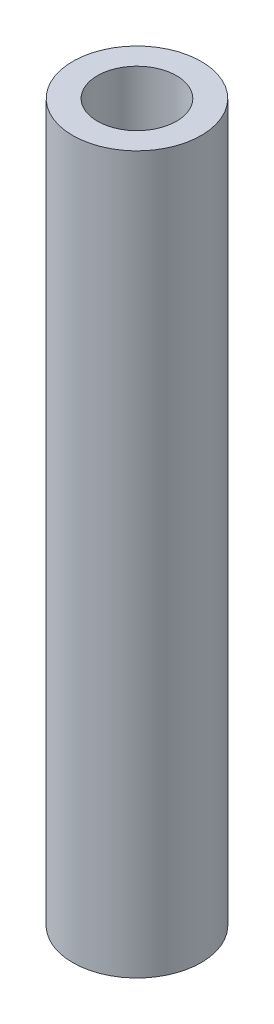
ISO-10303-21;
HEADER;
FILE_DESCRIPTION(('STEP AP214'),'2;1');
FILE_NAME('part.step','',(''),(''),'','','');
FILE_SCHEMA(('AUTOMOTIVE_DESIGN { 1 0 10303 214 1 1 1 1 }'));
ENDSEC;
DATA;
#1=APPLICATION_CONTEXT('core data for automotive mechanical design processes');
#2=APPLICATION_PROTOCOL_DEFINITION('international standard','automotive_design',2000,#1);
#3=PRODUCT_CONTEXT('',#1,'mechanical');
#4=PRODUCT('Part','Part','',(#3));
#5=PRODUCT_RELATED_PRODUCT_CATEGORY('part','',(#4));
#6=PRODUCT_DEFINITION_FORMATION('','',#4);
#7=PRODUCT_DEFINITION_CONTEXT('part definition',#1,'design');
#8=PRODUCT_DEFINITION('design','',#6,#7);
#9=PRODUCT_DEFINITION_SHAPE('','',#8);
#10=(LENGTH_UNIT() NAMED_UNIT(*) SI_UNIT(.MILLI.,.METRE.));
#11=(NAMED_UNIT(*) PLANE_ANGLE_UNIT() SI_UNIT($,.RADIAN.));
#12=(NAMED_UNIT(*) SI_UNIT($,.STERADIAN.) SOLID_ANGLE_UNIT());
#13=UNCERTAINTY_MEASURE_WITH_UNIT(LENGTH_MEASURE(1.E-05),#10,'distance_accuracy_value','');
#14=(GEOMETRIC_REPRESENTATION_CONTEXT(3) GLOBAL_UNCERTAINTY_ASSIGNED_CONTEXT((#13)) GLOBAL_UNIT_ASSIGNED_CONTEXT((#10,
#11,#12)) REPRESENTATION_CONTEXT('',''));
#15=CARTESIAN_POINT('',(0.,0.,0.));
#16=DIRECTION('',(0.,0.,1.));
#17=DIRECTION('',(1.,0.,0.));
#18=AXIS2_PLACEMENT_3D('',#15,#16,#17);
#19=CARTESIAN_POINT('',(0.,29.,0.));
#20=DIRECTION('',(0.,1.,0.));
#21=DIRECTION('',(0.,0.,1.));
#22=AXIS2_PLACEMENT_3D('',#19,#20,#21);
#23=PLANE('',#22);
#24=CARTESIAN_POINT('',(0.,29.,0.));
#25=DIRECTION('',(0.,1.,0.));
#26=DIRECTION('',(0.,0.,1.));
#27=AXIS2_PLACEMENT_3D('',#24,#25,#26);
#28=CIRCLE('',#27,2.6);
#29=CARTESIAN_POINT('',(0.,29.,2.6));
#30=VERTEX_POINT('',#29);
#31=EDGE_CURVE('E10',#30,#30,#28,.T.);
#32=ORIENTED_EDGE('',*,*,#31,.T.);
#33=EDGE_LOOP('',(#32));
#34=FACE_BOUND('',#33,.T.);
#35=CARTESIAN_POINT('',(0.,29.,0.));
#36=DIRECTION('',(0.,1.,0.));
#37=DIRECTION('',(0.,0.,1.));
#38=AXIS2_PLACEMENT_3D('',#35,#36,#37);
#39=CIRCLE('',#38,1.6);
#40=CARTESIAN_POINT('',(0.,29.,1.6));
#41=VERTEX_POINT('',#40);
#42=EDGE_CURVE('E50',#41,#41,#39,.T.);
#43=ORIENTED_EDGE('',*,*,#42,.F.);
#44=EDGE_LOOP('',(#43));
#45=FACE_BOUND('',#44,.T.);
#46=ADVANCED_FACE('F37',(#34,#45),#23,.T.);
#47=CARTESIAN_POINT('',(0.,0.,0.));
#48=DIRECTION('',(0.,1.,0.));
#49=DIRECTION('',(0.,0.,1.));
#50=AXIS2_PLACEMENT_3D('',#47,#48,#49);
#51=PLANE('',#50);
#52=CARTESIAN_POINT('',(0.,0.,0.));
#53=DIRECTION('',(0.,1.,0.));
#54=DIRECTION('',(0.,0.,1.));
#55=AXIS2_PLACEMENT_3D('',#52,#53,#54);
#56=CIRCLE('',#55,2.6);
#57=CARTESIAN_POINT('',(0.,0.,2.6));
#58=VERTEX_POINT('',#57);
#59=EDGE_CURVE('E41',#58,#58,#56,.T.);
#60=ORIENTED_EDGE('',*,*,#59,.F.);
#61=EDGE_LOOP('',(#60));
#62=FACE_BOUND('',#61,.T.);
#63=CARTESIAN_POINT('',(0.,0.,0.));
#64=DIRECTION('',(0.,1.,0.));
#65=DIRECTION('',(0.,0.,1.));
#66=AXIS2_PLACEMENT_3D('',#63,#64,#65);
#67=CIRCLE('',#66,1.6);
#68=CARTESIAN_POINT('',(0.,0.,1.6));
#69=VERTEX_POINT('',#68);
#70=EDGE_CURVE('E52',#69,#69,#67,.T.);
#71=ORIENTED_EDGE('',*,*,#70,.T.);
#72=EDGE_LOOP('',(#71));
#73=FACE_BOUND('',#72,.T.);
#74=ADVANCED_FACE('F64',(#62,#73),#51,.F.);
#75=CARTESIAN_POINT('',(0.,29.,0.));
#76=DIRECTION('',(0.,-1.,0.));
#77=DIRECTION('',(0.,0.,-1.));
#78=AXIS2_PLACEMENT_3D('',#75,#76,#77);
#79=CYLINDRICAL_SURFACE('',#78,2.6);
#80=ORIENTED_EDGE('',*,*,#31,.F.);
#81=EDGE_LOOP('',(#80));
#82=FACE_BOUND('',#81,.T.);
#83=ORIENTED_EDGE('',*,*,#59,.T.);
#84=EDGE_LOOP('',(#83));
#85=FACE_BOUND('',#84,.T.);
#86=ADVANCED_FACE('F39',(#82,#85),#79,.T.);
#87=CARTESIAN_POINT('',(0.,29.,0.));
#88=DIRECTION('',(0.,-1.,0.));
#89=DIRECTION('',(0.,0.,-1.));
#90=AXIS2_PLACEMENT_3D('',#87,#88,#89);
#91=CYLINDRICAL_SURFACE('',#90,1.6);
#92=ORIENTED_EDGE('',*,*,#42,.T.);
#93=EDGE_LOOP('',(#92));
#94=FACE_BOUND('',#93,.T.);
#95=ORIENTED_EDGE('',*,*,#70,.F.);
#96=EDGE_LOOP('',(#95));
#97=FACE_BOUND('',#96,.T.);
#98=ADVANCED_FACE('F60',(#94,#97),#91,.F.);
#99=CLOSED_SHELL('',(#46,#74,#86,#98));
#100=MANIFOLD_SOLID_BREP('B2',#99);
#101=ADVANCED_BREP_SHAPE_REPRESENTATION('',(#18,#100),#14);
#102=SHAPE_DEFINITION_REPRESENTATION(#9,#101);
ENDSEC;
END-ISO-10303-21;
